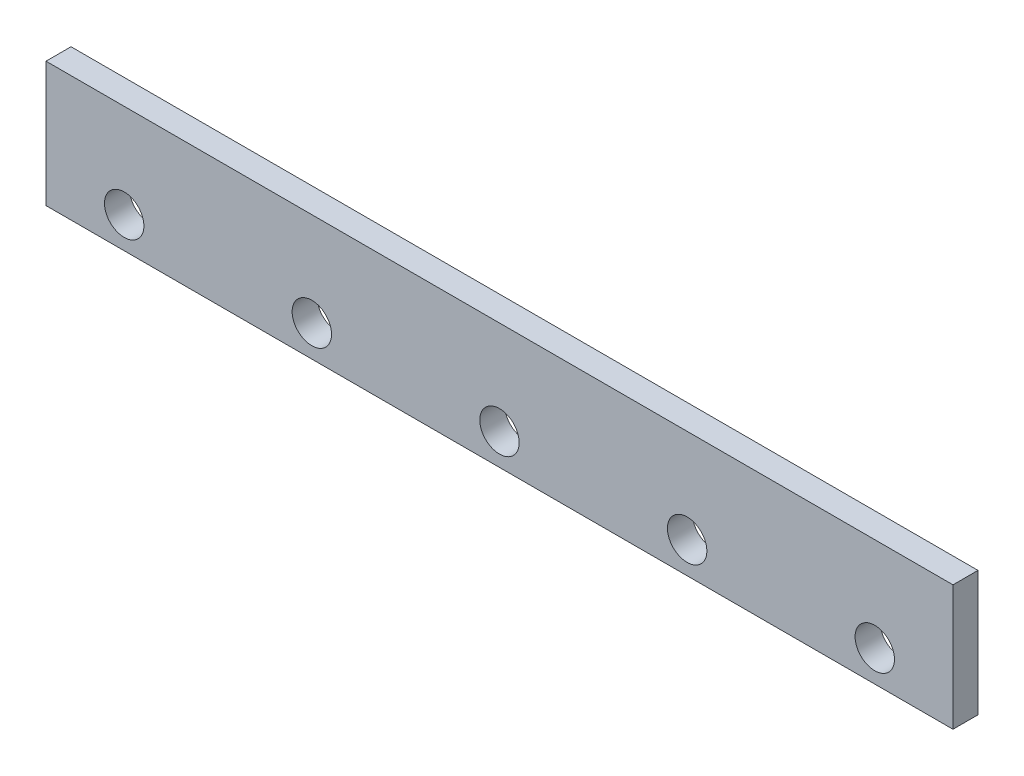
ISO-10303-21;
HEADER;
FILE_DESCRIPTION(('STEP AP214'),'2;1');
FILE_NAME('part.step','',(''),(''),'','','');
FILE_SCHEMA(('AUTOMOTIVE_DESIGN { 1 0 10303 214 1 1 1 1 }'));
ENDSEC;
DATA;
#1=APPLICATION_CONTEXT('core data for automotive mechanical design processes');
#2=APPLICATION_PROTOCOL_DEFINITION('international standard','automotive_design',2000,#1);
#3=PRODUCT_CONTEXT('',#1,'mechanical');
#4=PRODUCT('Part','Part','',(#3));
#5=PRODUCT_RELATED_PRODUCT_CATEGORY('part','',(#4));
#6=PRODUCT_DEFINITION_FORMATION('','',#4);
#7=PRODUCT_DEFINITION_CONTEXT('part definition',#1,'design');
#8=PRODUCT_DEFINITION('design','',#6,#7);
#9=PRODUCT_DEFINITION_SHAPE('','',#8);
#10=(LENGTH_UNIT() NAMED_UNIT(*) SI_UNIT(.MILLI.,.METRE.));
#11=(NAMED_UNIT(*) PLANE_ANGLE_UNIT() SI_UNIT($,.RADIAN.));
#12=(NAMED_UNIT(*) SI_UNIT($,.STERADIAN.) SOLID_ANGLE_UNIT());
#13=UNCERTAINTY_MEASURE_WITH_UNIT(LENGTH_MEASURE(1.E-05),#10,'distance_accuracy_value','');
#14=(GEOMETRIC_REPRESENTATION_CONTEXT(3) GLOBAL_UNCERTAINTY_ASSIGNED_CONTEXT((#13)) GLOBAL_UNIT_ASSIGNED_CONTEXT((#10,
#11,#12)) REPRESENTATION_CONTEXT('',''));
#15=CARTESIAN_POINT('',(0.,0.,0.));
#16=DIRECTION('',(0.,0.,1.));
#17=DIRECTION('',(1.,0.,0.));
#18=AXIS2_PLACEMENT_3D('',#15,#16,#17);
#19=CARTESIAN_POINT('',(0.,0.,16.));
#20=DIRECTION('',(0.,0.,-1.));
#21=DIRECTION('',(-1.,0.,0.));
#22=AXIS2_PLACEMENT_3D('',#19,#20,#21);
#23=PLANE('',#22);
#24=CARTESIAN_POINT('',(290.,20.,16.));
#25=DIRECTION('',(0.,0.,1.));
#26=DIRECTION('',(1.,0.,0.));
#27=AXIS2_PLACEMENT_3D('',#24,#25,#26);
#28=CIRCLE('',#27,12.6);
#29=CARTESIAN_POINT('',(302.6,20.,16.));
#30=VERTEX_POINT('',#29);
#31=EDGE_CURVE('E127',#30,#30,#28,.T.);
#32=ORIENTED_EDGE('',*,*,#31,.F.);
#33=EDGE_LOOP('',(#32));
#34=FACE_BOUND('',#33,.T.);
#35=CARTESIAN_POINT('',(170.,20.,16.));
#36=DIRECTION('',(0.,0.,1.));
#37=DIRECTION('',(1.,0.,0.));
#38=AXIS2_PLACEMENT_3D('',#35,#36,#37);
#39=CIRCLE('',#38,12.6);
#40=CARTESIAN_POINT('',(182.6,20.,16.));
#41=VERTEX_POINT('',#40);
#42=EDGE_CURVE('E115',#41,#41,#39,.T.);
#43=ORIENTED_EDGE('',*,*,#42,.F.);
#44=EDGE_LOOP('',(#43));
#45=FACE_BOUND('',#44,.T.);
#46=DIRECTION('',(0.,-1.,0.));
#47=VECTOR('',#46,1.);
#48=CARTESIAN_POINT('',(0.,0.,16.));
#49=LINE('',#48,#47);
#50=CARTESIAN_POINT('',(0.,80.,16.));
#51=VERTEX_POINT('',#50);
#52=CARTESIAN_POINT('',(0.,0.,16.));
#53=VERTEX_POINT('',#52);
#54=EDGE_CURVE('E85',#51,#53,#49,.T.);
#55=ORIENTED_EDGE('',*,*,#54,.T.);
#56=DIRECTION('',(1.,0.,0.));
#57=VECTOR('',#56,1.);
#58=CARTESIAN_POINT('',(0.,0.,16.));
#59=LINE('',#58,#57);
#60=CARTESIAN_POINT('',(580.,0.,16.));
#61=VERTEX_POINT('',#60);
#62=EDGE_CURVE('E80',#53,#61,#59,.T.);
#63=ORIENTED_EDGE('',*,*,#62,.T.);
#64=DIRECTION('',(0.,1.,0.));
#65=VECTOR('',#64,1.);
#66=CARTESIAN_POINT('',(580.,0.,16.));
#67=LINE('',#66,#65);
#68=CARTESIAN_POINT('',(580.,80.,16.));
#69=VERTEX_POINT('',#68);
#70=EDGE_CURVE('E83',#61,#69,#67,.T.);
#71=ORIENTED_EDGE('',*,*,#70,.T.);
#72=DIRECTION('',(-1.,0.,0.));
#73=VECTOR('',#72,1.);
#74=CARTESIAN_POINT('',(0.,80.,16.));
#75=LINE('',#74,#73);
#76=EDGE_CURVE('E50',#69,#51,#75,.T.);
#77=ORIENTED_EDGE('',*,*,#76,.T.);
#78=EDGE_LOOP('',(#55,#63,#71,#77));
#79=FACE_BOUND('',#78,.T.);
#80=CARTESIAN_POINT('',(50.,20.,16.));
#81=DIRECTION('',(0.,0.,1.));
#82=DIRECTION('',(1.,0.,0.));
#83=AXIS2_PLACEMENT_3D('',#80,#81,#82);
#84=CIRCLE('',#83,12.6);
#85=CARTESIAN_POINT('',(62.6,20.,16.));
#86=VERTEX_POINT('',#85);
#87=EDGE_CURVE('E100',#86,#86,#84,.T.);
#88=ORIENTED_EDGE('',*,*,#87,.F.);
#89=EDGE_LOOP('',(#88));
#90=FACE_BOUND('',#89,.T.);
#91=CARTESIAN_POINT('',(410.,20.,16.));
#92=DIRECTION('',(0.,0.,1.));
#93=DIRECTION('',(1.,0.,0.));
#94=AXIS2_PLACEMENT_3D('',#91,#92,#93);
#95=CIRCLE('',#94,12.6);
#96=CARTESIAN_POINT('',(422.6,20.,16.));
#97=VERTEX_POINT('',#96);
#98=EDGE_CURVE('E121',#97,#97,#95,.T.);
#99=ORIENTED_EDGE('',*,*,#98,.F.);
#100=EDGE_LOOP('',(#99));
#101=FACE_BOUND('',#100,.T.);
#102=CARTESIAN_POINT('',(530.,20.,16.));
#103=DIRECTION('',(0.,0.,1.));
#104=DIRECTION('',(1.,0.,0.));
#105=AXIS2_PLACEMENT_3D('',#102,#103,#104);
#106=CIRCLE('',#105,12.5999999999999);
#107=CARTESIAN_POINT('',(542.6,20.,16.));
#108=VERTEX_POINT('',#107);
#109=EDGE_CURVE('E133',#108,#108,#106,.T.);
#110=ORIENTED_EDGE('',*,*,#109,.F.);
#111=EDGE_LOOP('',(#110));
#112=FACE_BOUND('',#111,.T.);
#113=ADVANCED_FACE('F33',(#34,#45,#79,#90,#101,#112),#23,.F.);
#114=CARTESIAN_POINT('',(0.,0.,0.));
#115=DIRECTION('',(0.,0.,-1.));
#116=DIRECTION('',(-1.,0.,0.));
#117=AXIS2_PLACEMENT_3D('',#114,#115,#116);
#118=PLANE('',#117);
#119=CARTESIAN_POINT('',(290.,20.,0.));
#120=DIRECTION('',(0.,0.,1.));
#121=DIRECTION('',(1.,0.,0.));
#122=AXIS2_PLACEMENT_3D('',#119,#120,#121);
#123=CIRCLE('',#122,12.6);
#124=CARTESIAN_POINT('',(302.6,20.,0.));
#125=VERTEX_POINT('',#124);
#126=EDGE_CURVE('E130',#125,#125,#123,.T.);
#127=ORIENTED_EDGE('',*,*,#126,.T.);
#128=EDGE_LOOP('',(#127));
#129=FACE_BOUND('',#128,.T.);
#130=CARTESIAN_POINT('',(170.,20.,0.));
#131=DIRECTION('',(0.,0.,1.));
#132=DIRECTION('',(1.,0.,0.));
#133=AXIS2_PLACEMENT_3D('',#130,#131,#132);
#134=CIRCLE('',#133,12.6);
#135=CARTESIAN_POINT('',(182.6,20.,0.));
#136=VERTEX_POINT('',#135);
#137=EDGE_CURVE('E118',#136,#136,#134,.T.);
#138=ORIENTED_EDGE('',*,*,#137,.T.);
#139=EDGE_LOOP('',(#138));
#140=FACE_BOUND('',#139,.T.);
#141=DIRECTION('',(0.,-1.,0.));
#142=VECTOR('',#141,1.);
#143=CARTESIAN_POINT('',(0.,0.,0.));
#144=LINE('',#143,#142);
#145=CARTESIAN_POINT('',(0.,80.,0.));
#146=VERTEX_POINT('',#145);
#147=CARTESIAN_POINT('',(0.,0.,0.));
#148=VERTEX_POINT('',#147);
#149=EDGE_CURVE('E97',#146,#148,#144,.T.);
#150=ORIENTED_EDGE('',*,*,#149,.F.);
#151=DIRECTION('',(-1.,0.,0.));
#152=VECTOR('',#151,1.);
#153=CARTESIAN_POINT('',(0.,80.,0.));
#154=LINE('',#153,#152);
#155=CARTESIAN_POINT('',(580.,80.,0.));
#156=VERTEX_POINT('',#155);
#157=EDGE_CURVE('E73',#156,#146,#154,.T.);
#158=ORIENTED_EDGE('',*,*,#157,.F.);
#159=DIRECTION('',(0.,1.,0.));
#160=VECTOR('',#159,1.);
#161=CARTESIAN_POINT('',(580.,0.,0.));
#162=LINE('',#161,#160);
#163=CARTESIAN_POINT('',(580.,0.,0.));
#164=VERTEX_POINT('',#163);
#165=EDGE_CURVE('E67',#164,#156,#162,.T.);
#166=ORIENTED_EDGE('',*,*,#165,.F.);
#167=DIRECTION('',(1.,0.,0.));
#168=VECTOR('',#167,1.);
#169=CARTESIAN_POINT('',(0.,0.,0.));
#170=LINE('',#169,#168);
#171=EDGE_CURVE('E89',#148,#164,#170,.T.);
#172=ORIENTED_EDGE('',*,*,#171,.F.);
#173=EDGE_LOOP('',(#150,#158,#166,#172));
#174=FACE_BOUND('',#173,.T.);
#175=CARTESIAN_POINT('',(50.,20.,0.));
#176=DIRECTION('',(0.,0.,1.));
#177=DIRECTION('',(1.,0.,0.));
#178=AXIS2_PLACEMENT_3D('',#175,#176,#177);
#179=CIRCLE('',#178,12.6);
#180=CARTESIAN_POINT('',(62.6,20.,0.));
#181=VERTEX_POINT('',#180);
#182=EDGE_CURVE('E112',#181,#181,#179,.T.);
#183=ORIENTED_EDGE('',*,*,#182,.T.);
#184=EDGE_LOOP('',(#183));
#185=FACE_BOUND('',#184,.T.);
#186=CARTESIAN_POINT('',(410.,20.,0.));
#187=DIRECTION('',(0.,0.,1.));
#188=DIRECTION('',(1.,0.,0.));
#189=AXIS2_PLACEMENT_3D('',#186,#187,#188);
#190=CIRCLE('',#189,12.6);
#191=CARTESIAN_POINT('',(422.6,20.,0.));
#192=VERTEX_POINT('',#191);
#193=EDGE_CURVE('E124',#192,#192,#190,.T.);
#194=ORIENTED_EDGE('',*,*,#193,.T.);
#195=EDGE_LOOP('',(#194));
#196=FACE_BOUND('',#195,.T.);
#197=CARTESIAN_POINT('',(530.,20.,0.));
#198=DIRECTION('',(0.,0.,1.));
#199=DIRECTION('',(1.,0.,0.));
#200=AXIS2_PLACEMENT_3D('',#197,#198,#199);
#201=CIRCLE('',#200,12.5999999999999);
#202=CARTESIAN_POINT('',(542.6,20.,0.));
#203=VERTEX_POINT('',#202);
#204=EDGE_CURVE('E136',#203,#203,#201,.T.);
#205=ORIENTED_EDGE('',*,*,#204,.T.);
#206=EDGE_LOOP('',(#205));
#207=FACE_BOUND('',#206,.T.);
#208=ADVANCED_FACE('F108',(#129,#140,#174,#185,#196,#207),#118,.T.);
#209=CARTESIAN_POINT('',(0.,0.,16.));
#210=DIRECTION('',(1.,0.,0.));
#211=DIRECTION('',(0.,0.,-1.));
#212=AXIS2_PLACEMENT_3D('',#209,#210,#211);
#213=PLANE('',#212);
#214=ORIENTED_EDGE('',*,*,#149,.T.);
#215=DIRECTION('',(0.,0.,-1.));
#216=VECTOR('',#215,1.);
#217=CARTESIAN_POINT('',(0.,0.,16.));
#218=LINE('',#217,#216);
#219=EDGE_CURVE('E11',#53,#148,#218,.T.);
#220=ORIENTED_EDGE('',*,*,#219,.F.);
#221=ORIENTED_EDGE('',*,*,#54,.F.);
#222=DIRECTION('',(0.,0.,-1.));
#223=VECTOR('',#222,1.);
#224=CARTESIAN_POINT('',(0.,80.,16.));
#225=LINE('',#224,#223);
#226=EDGE_CURVE('E93',#51,#146,#225,.T.);
#227=ORIENTED_EDGE('',*,*,#226,.T.);
#228=EDGE_LOOP('',(#214,#220,#221,#227));
#229=FACE_BOUND('',#228,.T.);
#230=ADVANCED_FACE('F35',(#229),#213,.F.);
#231=CARTESIAN_POINT('',(0.,0.,16.));
#232=DIRECTION('',(0.,1.,0.));
#233=DIRECTION('',(0.,0.,1.));
#234=AXIS2_PLACEMENT_3D('',#231,#232,#233);
#235=PLANE('',#234);
#236=ORIENTED_EDGE('',*,*,#171,.T.);
#237=DIRECTION('',(0.,0.,-1.));
#238=VECTOR('',#237,1.);
#239=CARTESIAN_POINT('',(580.,0.,16.));
#240=LINE('',#239,#238);
#241=EDGE_CURVE('E42',#61,#164,#240,.T.);
#242=ORIENTED_EDGE('',*,*,#241,.F.);
#243=ORIENTED_EDGE('',*,*,#62,.F.);
#244=ORIENTED_EDGE('',*,*,#219,.T.);
#245=EDGE_LOOP('',(#236,#242,#243,#244));
#246=FACE_BOUND('',#245,.T.);
#247=ADVANCED_FACE('F88',(#246),#235,.F.);
#248=CARTESIAN_POINT('',(580.,0.,16.));
#249=DIRECTION('',(-1.,0.,0.));
#250=DIRECTION('',(0.,0.,1.));
#251=AXIS2_PLACEMENT_3D('',#248,#249,#250);
#252=PLANE('',#251);
#253=ORIENTED_EDGE('',*,*,#165,.T.);
#254=DIRECTION('',(0.,0.,-1.));
#255=VECTOR('',#254,1.);
#256=CARTESIAN_POINT('',(580.,80.,16.));
#257=LINE('',#256,#255);
#258=EDGE_CURVE('E90',#69,#156,#257,.T.);
#259=ORIENTED_EDGE('',*,*,#258,.F.);
#260=ORIENTED_EDGE('',*,*,#70,.F.);
#261=ORIENTED_EDGE('',*,*,#241,.T.);
#262=EDGE_LOOP('',(#253,#259,#260,#261));
#263=FACE_BOUND('',#262,.T.);
#264=ADVANCED_FACE('F91',(#263),#252,.F.);
#265=CARTESIAN_POINT('',(0.,80.,16.));
#266=DIRECTION('',(0.,-1.,0.));
#267=DIRECTION('',(0.,0.,-1.));
#268=AXIS2_PLACEMENT_3D('',#265,#266,#267);
#269=PLANE('',#268);
#270=ORIENTED_EDGE('',*,*,#157,.T.);
#271=ORIENTED_EDGE('',*,*,#226,.F.);
#272=ORIENTED_EDGE('',*,*,#76,.F.);
#273=ORIENTED_EDGE('',*,*,#258,.T.);
#274=EDGE_LOOP('',(#270,#271,#272,#273));
#275=FACE_BOUND('',#274,.T.);
#276=ADVANCED_FACE('F105',(#275),#269,.F.);
#277=CARTESIAN_POINT('',(50.,20.,16.));
#278=DIRECTION('',(0.,0.,-1.));
#279=DIRECTION('',(-1.,0.,0.));
#280=AXIS2_PLACEMENT_3D('',#277,#278,#279);
#281=CYLINDRICAL_SURFACE('',#280,12.6);
#282=ORIENTED_EDGE('',*,*,#87,.T.);
#283=EDGE_LOOP('',(#282));
#284=FACE_BOUND('',#283,.T.);
#285=ORIENTED_EDGE('',*,*,#182,.F.);
#286=EDGE_LOOP('',(#285));
#287=FACE_BOUND('',#286,.T.);
#288=ADVANCED_FACE('F156',(#284,#287),#281,.F.);
#289=CARTESIAN_POINT('',(170.,20.,16.));
#290=DIRECTION('',(0.,0.,-1.));
#291=DIRECTION('',(-1.,0.,0.));
#292=AXIS2_PLACEMENT_3D('',#289,#290,#291);
#293=CYLINDRICAL_SURFACE('',#292,12.6);
#294=ORIENTED_EDGE('',*,*,#42,.T.);
#295=EDGE_LOOP('',(#294));
#296=FACE_BOUND('',#295,.T.);
#297=ORIENTED_EDGE('',*,*,#137,.F.);
#298=EDGE_LOOP('',(#297));
#299=FACE_BOUND('',#298,.T.);
#300=ADVANCED_FACE('F202',(#296,#299),#293,.F.);
#301=CARTESIAN_POINT('',(410.,20.,16.));
#302=DIRECTION('',(0.,0.,-1.));
#303=DIRECTION('',(-1.,0.,0.));
#304=AXIS2_PLACEMENT_3D('',#301,#302,#303);
#305=CYLINDRICAL_SURFACE('',#304,12.6);
#306=ORIENTED_EDGE('',*,*,#98,.T.);
#307=EDGE_LOOP('',(#306));
#308=FACE_BOUND('',#307,.T.);
#309=ORIENTED_EDGE('',*,*,#193,.F.);
#310=EDGE_LOOP('',(#309));
#311=FACE_BOUND('',#310,.T.);
#312=ADVANCED_FACE('F210',(#308,#311),#305,.F.);
#313=CARTESIAN_POINT('',(290.,20.,16.));
#314=DIRECTION('',(0.,0.,-1.));
#315=DIRECTION('',(-1.,0.,0.));
#316=AXIS2_PLACEMENT_3D('',#313,#314,#315);
#317=CYLINDRICAL_SURFACE('',#316,12.6);
#318=ORIENTED_EDGE('',*,*,#31,.T.);
#319=EDGE_LOOP('',(#318));
#320=FACE_BOUND('',#319,.T.);
#321=ORIENTED_EDGE('',*,*,#126,.F.);
#322=EDGE_LOOP('',(#321));
#323=FACE_BOUND('',#322,.T.);
#324=ADVANCED_FACE('F218',(#320,#323),#317,.F.);
#325=CARTESIAN_POINT('',(530.,20.,16.));
#326=DIRECTION('',(0.,0.,-1.));
#327=DIRECTION('',(-1.,0.,0.));
#328=AXIS2_PLACEMENT_3D('',#325,#326,#327);
#329=CYLINDRICAL_SURFACE('',#328,12.5999999999999);
#330=ORIENTED_EDGE('',*,*,#109,.T.);
#331=EDGE_LOOP('',(#330));
#332=FACE_BOUND('',#331,.T.);
#333=ORIENTED_EDGE('',*,*,#204,.F.);
#334=EDGE_LOOP('',(#333));
#335=FACE_BOUND('',#334,.T.);
#336=ADVANCED_FACE('F142',(#332,#335),#329,.F.);
#337=CLOSED_SHELL('',(#113,#208,#230,#247,#264,#276,#288,#300,#312,#324,#336));
#338=MANIFOLD_SOLID_BREP('B2',#337);
#339=ADVANCED_BREP_SHAPE_REPRESENTATION('',(#18,#338),#14);
#340=SHAPE_DEFINITION_REPRESENTATION(#9,#339);
ENDSEC;
END-ISO-10303-21;
